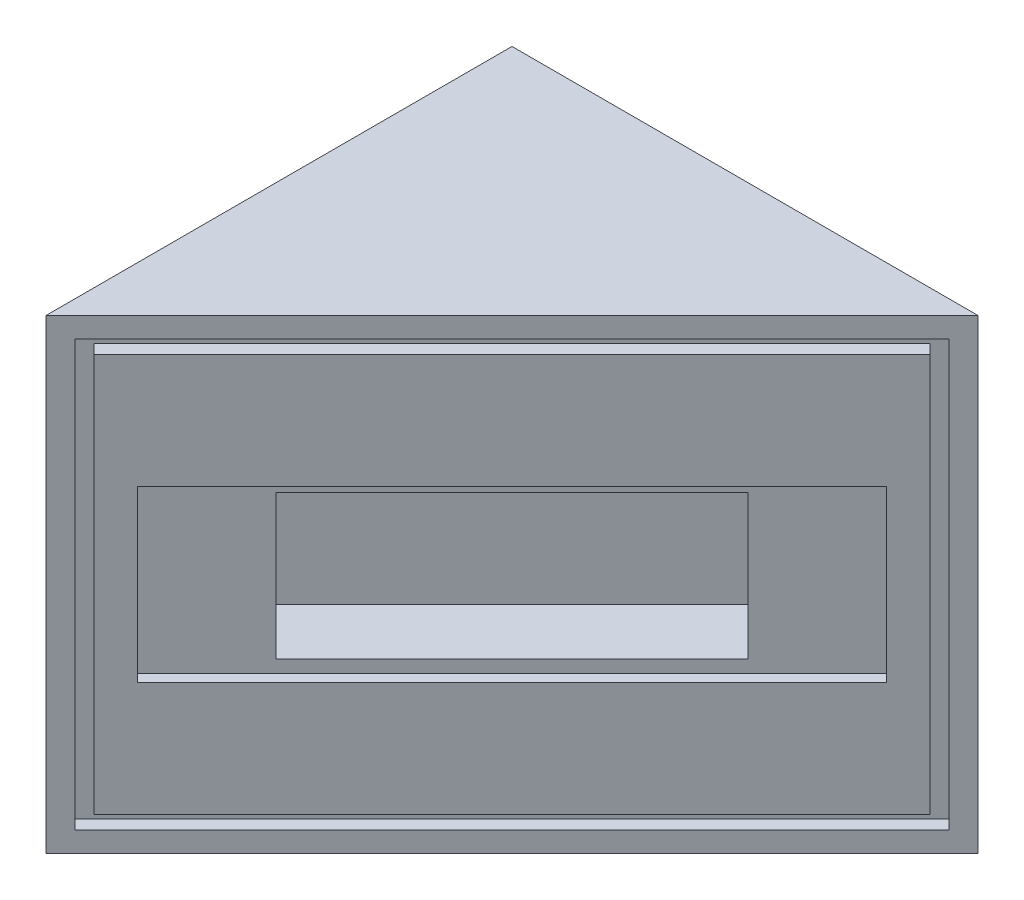
ISO-10303-21;
HEADER;
FILE_DESCRIPTION(('STEP AP214'),'2;1');
FILE_NAME('part.step','',(''),(''),'','','');
FILE_SCHEMA(('AUTOMOTIVE_DESIGN { 1 0 10303 214 1 1 1 1 }'));
ENDSEC;
DATA;
#1=APPLICATION_CONTEXT('core data for automotive mechanical design processes');
#2=APPLICATION_PROTOCOL_DEFINITION('international standard','automotive_design',2000,#1);
#3=PRODUCT_CONTEXT('',#1,'mechanical');
#4=PRODUCT('Part','Part','',(#3));
#5=PRODUCT_RELATED_PRODUCT_CATEGORY('part','',(#4));
#6=PRODUCT_DEFINITION_FORMATION('','',#4);
#7=PRODUCT_DEFINITION_CONTEXT('part definition',#1,'design');
#8=PRODUCT_DEFINITION('design','',#6,#7);
#9=PRODUCT_DEFINITION_SHAPE('','',#8);
#10=(LENGTH_UNIT() NAMED_UNIT(*) SI_UNIT(.MILLI.,.METRE.));
#11=(NAMED_UNIT(*) PLANE_ANGLE_UNIT() SI_UNIT($,.RADIAN.));
#12=(NAMED_UNIT(*) SI_UNIT($,.STERADIAN.) SOLID_ANGLE_UNIT());
#13=UNCERTAINTY_MEASURE_WITH_UNIT(LENGTH_MEASURE(1.E-05),#10,'distance_accuracy_value','');
#14=(GEOMETRIC_REPRESENTATION_CONTEXT(3) GLOBAL_UNCERTAINTY_ASSIGNED_CONTEXT((#13)) GLOBAL_UNIT_ASSIGNED_CONTEXT((#10,
#11,#12)) REPRESENTATION_CONTEXT('',''));
#15=CARTESIAN_POINT('',(0.,0.,0.));
#16=DIRECTION('',(0.,0.,1.));
#17=DIRECTION('',(1.,0.,0.));
#18=AXIS2_PLACEMENT_3D('',#15,#16,#17);
#19=CARTESIAN_POINT('',(0.,69.85,-69.85));
#20=DIRECTION('',(0.,0.,1.));
#21=DIRECTION('',(1.,0.,0.));
#22=AXIS2_PLACEMENT_3D('',#19,#20,#21);
#23=PLANE('',#22);
#24=DIRECTION('',(-1.,0.,0.));
#25=VECTOR('',#24,1.);
#26=CARTESIAN_POINT('',(0.,0.,-69.85));
#27=LINE('',#26,#25);
#28=CARTESIAN_POINT('',(69.85,0.,-69.85));
#29=VERTEX_POINT('',#28);
#30=CARTESIAN_POINT('',(0.,0.,-69.85));
#31=VERTEX_POINT('',#30);
#32=EDGE_CURVE('E67',#29,#31,#27,.T.);
#33=ORIENTED_EDGE('',*,*,#32,.T.);
#34=DIRECTION('',(0.,-1.,0.));
#35=VECTOR('',#34,1.);
#36=CARTESIAN_POINT('',(0.,69.85,-69.85));
#37=LINE('',#36,#35);
#38=CARTESIAN_POINT('',(0.,69.85,-69.85));
#39=VERTEX_POINT('',#38);
#40=EDGE_CURVE('E92',#39,#31,#37,.T.);
#41=ORIENTED_EDGE('',*,*,#40,.F.);
#42=DIRECTION('',(-1.,0.,0.));
#43=VECTOR('',#42,1.);
#44=CARTESIAN_POINT('',(0.,69.85,-69.85));
#45=LINE('',#44,#43);
#46=CARTESIAN_POINT('',(69.85,69.85,-69.85));
#47=VERTEX_POINT('',#46);
#48=EDGE_CURVE('E63',#47,#39,#45,.T.);
#49=ORIENTED_EDGE('',*,*,#48,.F.);
#50=DIRECTION('',(0.,-1.,0.));
#51=VECTOR('',#50,1.);
#52=CARTESIAN_POINT('',(69.8499999999999,69.85,-69.85));
#53=LINE('',#52,#51);
#54=EDGE_CURVE('E12',#47,#29,#53,.T.);
#55=ORIENTED_EDGE('',*,*,#54,.T.);
#56=EDGE_LOOP('',(#33,#41,#49,#55));
#57=FACE_BOUND('',#56,.T.);
#58=ADVANCED_FACE('F57',(#57),#23,.F.);
#59=CARTESIAN_POINT('',(0.,69.85,0.));
#60=DIRECTION('',(1.,0.,0.));
#61=DIRECTION('',(0.,0.,-1.));
#62=AXIS2_PLACEMENT_3D('',#59,#60,#61);
#63=PLANE('',#62);
#64=DIRECTION('',(0.,0.,1.));
#65=VECTOR('',#64,1.);
#66=CARTESIAN_POINT('',(0.,0.,0.));
#67=LINE('',#66,#65);
#68=CARTESIAN_POINT('',(0.,0.,0.));
#69=VERTEX_POINT('',#68);
#70=EDGE_CURVE('E87',#31,#69,#67,.T.);
#71=ORIENTED_EDGE('',*,*,#70,.T.);
#72=DIRECTION('',(0.,-1.,0.));
#73=VECTOR('',#72,1.);
#74=CARTESIAN_POINT('',(0.,69.85,0.));
#75=LINE('',#74,#73);
#76=CARTESIAN_POINT('',(0.,69.85,0.));
#77=VERTEX_POINT('',#76);
#78=EDGE_CURVE('E90',#77,#69,#75,.T.);
#79=ORIENTED_EDGE('',*,*,#78,.F.);
#80=DIRECTION('',(0.,0.,1.));
#81=VECTOR('',#80,1.);
#82=CARTESIAN_POINT('',(0.,69.85,0.));
#83=LINE('',#82,#81);
#84=EDGE_CURVE('E96',#39,#77,#83,.T.);
#85=ORIENTED_EDGE('',*,*,#84,.F.);
#86=ORIENTED_EDGE('',*,*,#40,.T.);
#87=EDGE_LOOP('',(#71,#79,#85,#86));
#88=FACE_BOUND('',#87,.T.);
#89=ADVANCED_FACE('F89',(#88),#63,.F.);
#90=OPEN_SHELL('',(#58,#89));
#91=SHELL_BASED_SURFACE_MODEL('B2',(#90));
#92=CARTESIAN_POINT('',(0.,69.85,0.));
#93=DIRECTION('',(0.,-1.,0.));
#94=DIRECTION('',(0.,0.,-1.));
#95=AXIS2_PLACEMENT_3D('',#92,#93,#94);
#96=PLANE('',#95);
#97=DIRECTION('',(-0.707106781186548,0.,0.707106781186547));
#98=VECTOR('',#97,1.);
#99=CARTESIAN_POINT('',(34.925,69.85,-34.9249999999999));
#100=LINE('',#99,#98);
#101=CARTESIAN_POINT('',(69.85,69.85,-69.85));
#102=VERTEX_POINT('',#101);
#103=CARTESIAN_POINT('',(0.,69.85,0.));
#104=VERTEX_POINT('',#103);
#105=EDGE_CURVE('E440',#102,#104,#100,.T.);
#106=ORIENTED_EDGE('',*,*,#105,.F.);
#107=DIRECTION('',(-1.,0.,0.));
#108=VECTOR('',#107,1.);
#109=CARTESIAN_POINT('',(0.,69.85,-69.85));
#110=LINE('',#109,#108);
#111=CARTESIAN_POINT('',(0.,69.85,-69.85));
#112=VERTEX_POINT('',#111);
#113=EDGE_CURVE('E460',#102,#112,#110,.T.);
#114=ORIENTED_EDGE('',*,*,#113,.T.);
#115=DIRECTION('',(0.,0.,1.));
#116=VECTOR('',#115,1.);
#117=CARTESIAN_POINT('',(0.,69.85,0.));
#118=LINE('',#117,#116);
#119=EDGE_CURVE('E456',#112,#104,#118,.T.);
#120=ORIENTED_EDGE('',*,*,#119,.T.);
#121=EDGE_LOOP('',(#106,#114,#120));
#122=FACE_BOUND('',#121,.T.);
#123=ADVANCED_FACE('F137',(#122),#96,.F.);
#124=CARTESIAN_POINT('',(0.,0.,0.));
#125=DIRECTION('',(0.,-1.,0.));
#126=DIRECTION('',(0.,0.,-1.));
#127=AXIS2_PLACEMENT_3D('',#124,#125,#126);
#128=PLANE('',#127);
#129=DIRECTION('',(-1.,0.,0.));
#130=VECTOR('',#129,1.);
#131=CARTESIAN_POINT('',(0.,0.,-69.85));
#132=LINE('',#131,#130);
#133=CARTESIAN_POINT('',(69.85,0.,-69.85));
#134=VERTEX_POINT('',#133);
#135=CARTESIAN_POINT('',(0.,0.,-69.85));
#136=VERTEX_POINT('',#135);
#137=EDGE_CURVE('E461',#134,#136,#132,.T.);
#138=ORIENTED_EDGE('',*,*,#137,.F.);
#139=DIRECTION('',(0.707106781186547,0.,-0.707106781186547));
#140=VECTOR('',#139,1.);
#141=CARTESIAN_POINT('',(69.85,0.,-69.85));
#142=LINE('',#141,#140);
#143=CARTESIAN_POINT('',(0.,0.,0.));
#144=VERTEX_POINT('',#143);
#145=EDGE_CURVE('E452',#144,#134,#142,.T.);
#146=ORIENTED_EDGE('',*,*,#145,.F.);
#147=DIRECTION('',(0.,0.,1.));
#148=VECTOR('',#147,1.);
#149=CARTESIAN_POINT('',(0.,0.,0.));
#150=LINE('',#149,#148);
#151=EDGE_CURVE('E455',#136,#144,#150,.T.);
#152=ORIENTED_EDGE('',*,*,#151,.F.);
#153=EDGE_LOOP('',(#138,#146,#152));
#154=FACE_BOUND('',#153,.T.);
#155=ADVANCED_FACE('F484',(#154),#128,.T.);
#156=CARTESIAN_POINT('',(0.,69.85,0.));
#157=DIRECTION('',(1.,0.,0.));
#158=DIRECTION('',(0.,0.,-1.));
#159=AXIS2_PLACEMENT_3D('',#156,#157,#158);
#160=PLANE('',#159);
#161=ORIENTED_EDGE('',*,*,#151,.T.);
#162=DIRECTION('',(0.,-1.,0.));
#163=VECTOR('',#162,1.);
#164=CARTESIAN_POINT('',(0.,69.85,0.));
#165=LINE('',#164,#163);
#166=EDGE_CURVE('E55',#104,#144,#165,.T.);
#167=ORIENTED_EDGE('',*,*,#166,.F.);
#168=ORIENTED_EDGE('',*,*,#119,.F.);
#169=DIRECTION('',(0.,-1.,0.));
#170=VECTOR('',#169,1.);
#171=CARTESIAN_POINT('',(0.,69.85,-69.85));
#172=LINE('',#171,#170);
#173=EDGE_CURVE('E464',#112,#136,#172,.T.);
#174=ORIENTED_EDGE('',*,*,#173,.T.);
#175=EDGE_LOOP('',(#161,#167,#168,#174));
#176=FACE_BOUND('',#175,.T.);
#177=ADVANCED_FACE('F139',(#176),#160,.F.);
#178=CARTESIAN_POINT('',(0.,69.85,-69.85));
#179=DIRECTION('',(0.,0.,1.));
#180=DIRECTION('',(1.,0.,0.));
#181=AXIS2_PLACEMENT_3D('',#178,#179,#180);
#182=PLANE('',#181);
#183=ORIENTED_EDGE('',*,*,#137,.T.);
#184=ORIENTED_EDGE('',*,*,#173,.F.);
#185=ORIENTED_EDGE('',*,*,#113,.F.);
#186=DIRECTION('',(0.,-1.,0.));
#187=VECTOR('',#186,1.);
#188=CARTESIAN_POINT('',(69.8499999999999,69.85,-69.85));
#189=LINE('',#188,#187);
#190=EDGE_CURVE('E146',#102,#134,#189,.T.);
#191=ORIENTED_EDGE('',*,*,#190,.T.);
#192=EDGE_LOOP('',(#183,#184,#185,#191));
#193=FACE_BOUND('',#192,.T.);
#194=ADVANCED_FACE('F477',(#193),#182,.F.);
#195=CARTESIAN_POINT('',(0.,0.,0.));
#196=DIRECTION('',(0.707106781186548,0.,0.707106781186548));
#197=DIRECTION('',(0.707106781186548,0.,-0.707106781186548));
#198=AXIS2_PLACEMENT_3D('',#195,#196,#197);
#199=PLANE('',#198);
#200=DIRECTION('',(0.,1.,0.));
#201=VECTOR('',#200,1.);
#202=CARTESIAN_POINT('',(67.6947385309433,3.04800000000001,-67.6947385309433));
#203=LINE('',#202,#201);
#204=CARTESIAN_POINT('',(67.6947385309433,3.04800000000001,-67.6947385309433));
#205=VERTEX_POINT('',#204);
#206=CARTESIAN_POINT('',(67.6947385309433,66.802,-67.6947385309433));
#207=VERTEX_POINT('',#206);
#208=EDGE_CURVE('E396',#205,#207,#203,.T.);
#209=ORIENTED_EDGE('',*,*,#208,.F.);
#210=DIRECTION('',(0.707106781186547,0.,-0.707106781186548));
#211=VECTOR('',#210,1.);
#212=CARTESIAN_POINT('',(2.1552614690566,3.048,-2.1552614690566));
#213=LINE('',#212,#211);
#214=CARTESIAN_POINT('',(2.1552614690566,3.048,-2.1552614690566));
#215=VERTEX_POINT('',#214);
#216=EDGE_CURVE('E411',#215,#205,#213,.T.);
#217=ORIENTED_EDGE('',*,*,#216,.F.);
#218=DIRECTION('',(0.,-1.,0.));
#219=VECTOR('',#218,1.);
#220=CARTESIAN_POINT('',(2.1552614690566,66.802,-2.1552614690566));
#221=LINE('',#220,#219);
#222=CARTESIAN_POINT('',(2.1552614690566,66.802,-2.1552614690566));
#223=VERTEX_POINT('',#222);
#224=EDGE_CURVE('E430',#223,#215,#221,.T.);
#225=ORIENTED_EDGE('',*,*,#224,.F.);
#226=DIRECTION('',(-0.707106781186548,0.,0.707106781186548));
#227=VECTOR('',#226,1.);
#228=CARTESIAN_POINT('',(67.6947385309433,66.802,-67.6947385309433));
#229=LINE('',#228,#227);
#230=EDGE_CURVE('E426',#207,#223,#229,.T.);
#231=ORIENTED_EDGE('',*,*,#230,.F.);
#232=EDGE_LOOP('',(#209,#217,#225,#231));
#233=FACE_BOUND('',#232,.T.);
#234=ORIENTED_EDGE('',*,*,#105,.T.);
#235=ORIENTED_EDGE('',*,*,#166,.T.);
#236=ORIENTED_EDGE('',*,*,#145,.T.);
#237=ORIENTED_EDGE('',*,*,#190,.F.);
#238=EDGE_LOOP('',(#234,#235,#236,#237));
#239=FACE_BOUND('',#238,.T.);
#240=ADVANCED_FACE('F489',(#233,#239),#199,.T.);
#241=CARTESIAN_POINT('',(66.2578975515722,3.04800000000001,-69.1315795103144));
#242=DIRECTION('',(0.707106781186547,0.,-0.707106781186548));
#243=DIRECTION('',(-0.707106781186548,0.,-0.707106781186547));
#244=AXIS2_PLACEMENT_3D('',#241,#242,#243);
#245=PLANE('',#244);
#246=ORIENTED_EDGE('',*,*,#208,.T.);
#247=DIRECTION('',(0.707106781186548,0.,0.707106781186547));
#248=VECTOR('',#247,1.);
#249=CARTESIAN_POINT('',(66.2578975515723,66.802,-69.1315795103144));
#250=LINE('',#249,#248);
#251=CARTESIAN_POINT('',(66.2578975515723,66.802,-69.1315795103144));
#252=VERTEX_POINT('',#251);
#253=EDGE_CURVE('E423',#252,#207,#250,.T.);
#254=ORIENTED_EDGE('',*,*,#253,.F.);
#255=DIRECTION('',(0.,1.,0.));
#256=VECTOR('',#255,1.);
#257=CARTESIAN_POINT('',(66.2578975515722,3.04800000000001,-69.1315795103144));
#258=LINE('',#257,#256);
#259=CARTESIAN_POINT('',(66.2578975515722,3.04800000000001,-69.1315795103144));
#260=VERTEX_POINT('',#259);
#261=EDGE_CURVE('E406',#260,#252,#258,.T.);
#262=ORIENTED_EDGE('',*,*,#261,.F.);
#263=DIRECTION('',(0.707106781186548,0.,0.707106781186547));
#264=VECTOR('',#263,1.);
#265=CARTESIAN_POINT('',(66.2578975515722,3.04800000000001,-69.1315795103144));
#266=LINE('',#265,#264);
#267=EDGE_CURVE('E437',#260,#205,#266,.T.);
#268=ORIENTED_EDGE('',*,*,#267,.T.);
#269=EDGE_LOOP('',(#246,#254,#262,#268));
#270=FACE_BOUND('',#269,.T.);
#271=ADVANCED_FACE('F491',(#270),#245,.F.);
#272=CARTESIAN_POINT('',(0.718420489685539,3.048,-3.59210244842767));
#273=DIRECTION('',(0.,-1.,0.));
#274=DIRECTION('',(0.,0.,-1.));
#275=AXIS2_PLACEMENT_3D('',#272,#273,#274);
#276=PLANE('',#275);
#277=ORIENTED_EDGE('',*,*,#216,.T.);
#278=ORIENTED_EDGE('',*,*,#267,.F.);
#279=DIRECTION('',(0.707106781186547,0.,-0.707106781186548));
#280=VECTOR('',#279,1.);
#281=CARTESIAN_POINT('',(0.718420489685539,3.048,-3.59210244842767));
#282=LINE('',#281,#280);
#283=CARTESIAN_POINT('',(0.718420489685539,3.048,-3.59210244842767));
#284=VERTEX_POINT('',#283);
#285=EDGE_CURVE('E419',#284,#260,#282,.T.);
#286=ORIENTED_EDGE('',*,*,#285,.F.);
#287=DIRECTION('',(0.707106781186548,0.,0.707106781186547));
#288=VECTOR('',#287,1.);
#289=CARTESIAN_POINT('',(0.718420489685539,3.048,-3.59210244842767));
#290=LINE('',#289,#288);
#291=EDGE_CURVE('E441',#284,#215,#290,.T.);
#292=ORIENTED_EDGE('',*,*,#291,.T.);
#293=EDGE_LOOP('',(#277,#278,#286,#292));
#294=FACE_BOUND('',#293,.T.);
#295=ADVANCED_FACE('F499',(#294),#276,.F.);
#296=CARTESIAN_POINT('',(0.718420489685538,66.802,-3.59210244842767));
#297=DIRECTION('',(-0.707106781186547,0.,0.707106781186548));
#298=DIRECTION('',(0.707106781186548,0.,0.707106781186547));
#299=AXIS2_PLACEMENT_3D('',#296,#297,#298);
#300=PLANE('',#299);
#301=ORIENTED_EDGE('',*,*,#224,.T.);
#302=ORIENTED_EDGE('',*,*,#291,.F.);
#303=DIRECTION('',(0.,-1.,0.));
#304=VECTOR('',#303,1.);
#305=CARTESIAN_POINT('',(0.718420489685538,66.802,-3.59210244842767));
#306=LINE('',#305,#304);
#307=CARTESIAN_POINT('',(0.718420489685538,66.802,-3.59210244842767));
#308=VERTEX_POINT('',#307);
#309=EDGE_CURVE('E415',#308,#284,#306,.T.);
#310=ORIENTED_EDGE('',*,*,#309,.F.);
#311=DIRECTION('',(0.707106781186548,0.,0.707106781186547));
#312=VECTOR('',#311,1.);
#313=CARTESIAN_POINT('',(0.718420489685538,66.802,-3.59210244842767));
#314=LINE('',#313,#312);
#315=EDGE_CURVE('E444',#308,#223,#314,.T.);
#316=ORIENTED_EDGE('',*,*,#315,.T.);
#317=EDGE_LOOP('',(#301,#302,#310,#316));
#318=FACE_BOUND('',#317,.T.);
#319=ADVANCED_FACE('F547',(#318),#300,.F.);
#320=CARTESIAN_POINT('',(66.2578975515723,66.802,-69.1315795103144));
#321=DIRECTION('',(0.,1.,0.));
#322=DIRECTION('',(0.,0.,1.));
#323=AXIS2_PLACEMENT_3D('',#320,#321,#322);
#324=PLANE('',#323);
#325=ORIENTED_EDGE('',*,*,#230,.T.);
#326=ORIENTED_EDGE('',*,*,#315,.F.);
#327=DIRECTION('',(-0.707106781186548,0.,0.707106781186548));
#328=VECTOR('',#327,1.);
#329=CARTESIAN_POINT('',(66.2578975515723,66.802,-69.1315795103144));
#330=LINE('',#329,#328);
#331=EDGE_CURVE('E410',#252,#308,#330,.T.);
#332=ORIENTED_EDGE('',*,*,#331,.F.);
#333=ORIENTED_EDGE('',*,*,#253,.T.);
#334=EDGE_LOOP('',(#325,#326,#332,#333));
#335=FACE_BOUND('',#334,.T.);
#336=ADVANCED_FACE('F558',(#335),#324,.F.);
#337=CARTESIAN_POINT('',(-1.43684097937107,0.,-1.43684097937107));
#338=DIRECTION('',(0.707106781186548,0.,0.707106781186547));
#339=DIRECTION('',(0.707106781186547,0.,-0.707106781186548));
#340=AXIS2_PLACEMENT_3D('',#337,#338,#339);
#341=PLANE('',#340);
#342=DIRECTION('',(0.707106781186547,0.,-0.707106781186548));
#343=VECTOR('',#342,1.);
#344=CARTESIAN_POINT('',(2.1552614690566,5.08,-5.02894342779873));
#345=LINE('',#344,#343);
#346=CARTESIAN_POINT('',(2.1552614690566,5.08,-5.02894342779873));
#347=VERTEX_POINT('',#346);
#348=CARTESIAN_POINT('',(64.8210565722012,5.08,-67.6947385309434));
#349=VERTEX_POINT('',#348);
#350=EDGE_CURVE('E374',#347,#349,#345,.T.);
#351=ORIENTED_EDGE('',*,*,#350,.F.);
#352=DIRECTION('',(0.,-1.,0.));
#353=VECTOR('',#352,1.);
#354=CARTESIAN_POINT('',(2.1552614690566,64.77,-5.02894342779873));
#355=LINE('',#354,#353);
#356=CARTESIAN_POINT('',(2.1552614690566,64.77,-5.02894342779873));
#357=VERTEX_POINT('',#356);
#358=EDGE_CURVE('E370',#357,#347,#355,.T.);
#359=ORIENTED_EDGE('',*,*,#358,.F.);
#360=DIRECTION('',(-0.707106781186547,0.,0.707106781186548));
#361=VECTOR('',#360,1.);
#362=CARTESIAN_POINT('',(64.8210565722012,64.77,-67.6947385309434));
#363=LINE('',#362,#361);
#364=CARTESIAN_POINT('',(64.8210565722012,64.77,-67.6947385309434));
#365=VERTEX_POINT('',#364);
#366=EDGE_CURVE('E365',#365,#357,#363,.T.);
#367=ORIENTED_EDGE('',*,*,#366,.F.);
#368=DIRECTION('',(0.,1.,0.));
#369=VECTOR('',#368,1.);
#370=CARTESIAN_POINT('',(64.8210565722012,5.08,-67.6947385309434));
#371=LINE('',#370,#369);
#372=EDGE_CURVE('E361',#349,#365,#371,.T.);
#373=ORIENTED_EDGE('',*,*,#372,.F.);
#374=EDGE_LOOP('',(#351,#359,#367,#373));
#375=FACE_BOUND('',#374,.T.);
#376=ORIENTED_EDGE('',*,*,#261,.T.);
#377=ORIENTED_EDGE('',*,*,#331,.T.);
#378=ORIENTED_EDGE('',*,*,#309,.T.);
#379=ORIENTED_EDGE('',*,*,#285,.T.);
#380=EDGE_LOOP('',(#376,#377,#378,#379));
#381=FACE_BOUND('',#380,.T.);
#382=ADVANCED_FACE('F569',(#375,#381),#341,.T.);
#383=CARTESIAN_POINT('',(64.8210565722012,5.08,-67.6947385309434));
#384=DIRECTION('',(0.707106781186547,0.,-0.707106781186548));
#385=DIRECTION('',(-0.707106781186548,0.,-0.707106781186547));
#386=AXIS2_PLACEMENT_3D('',#383,#384,#385);
#387=PLANE('',#386);
#388=DIRECTION('',(0.,1.,0.));
#389=VECTOR('',#388,1.);
#390=CARTESIAN_POINT('',(66.2578975515723,5.08,-66.2578975515723));
#391=LINE('',#390,#389);
#392=CARTESIAN_POINT('',(66.2578975515723,5.08,-66.2578975515723));
#393=VERTEX_POINT('',#392);
#394=CARTESIAN_POINT('',(66.2578975515723,64.77,-66.2578975515723));
#395=VERTEX_POINT('',#394);
#396=EDGE_CURVE('E352',#393,#395,#391,.T.);
#397=ORIENTED_EDGE('',*,*,#396,.F.);
#398=DIRECTION('',(0.707106781186548,0.,0.707106781186547));
#399=VECTOR('',#398,1.);
#400=CARTESIAN_POINT('',(64.8210565722012,5.08,-67.6947385309434));
#401=LINE('',#400,#399);
#402=EDGE_CURVE('E393',#349,#393,#401,.T.);
#403=ORIENTED_EDGE('',*,*,#402,.F.);
#404=ORIENTED_EDGE('',*,*,#372,.T.);
#405=DIRECTION('',(0.707106781186548,0.,0.707106781186547));
#406=VECTOR('',#405,1.);
#407=CARTESIAN_POINT('',(64.8210565722012,64.77,-67.6947385309434));
#408=LINE('',#407,#406);
#409=EDGE_CURVE('E378',#365,#395,#408,.T.);
#410=ORIENTED_EDGE('',*,*,#409,.T.);
#411=EDGE_LOOP('',(#397,#403,#404,#410));
#412=FACE_BOUND('',#411,.T.);
#413=ADVANCED_FACE('F580',(#412),#387,.T.);
#414=CARTESIAN_POINT('',(2.1552614690566,5.08,-5.02894342779873));
#415=DIRECTION('',(0.,-1.,0.));
#416=DIRECTION('',(0.,0.,-1.));
#417=AXIS2_PLACEMENT_3D('',#414,#415,#416);
#418=PLANE('',#417);
#419=DIRECTION('',(0.707106781186547,0.,-0.707106781186548));
#420=VECTOR('',#419,1.);
#421=CARTESIAN_POINT('',(3.59210244842766,5.08,-3.59210244842767));
#422=LINE('',#421,#420);
#423=CARTESIAN_POINT('',(3.59210244842766,5.08,-3.59210244842767));
#424=VERTEX_POINT('',#423);
#425=EDGE_CURVE('E366',#424,#393,#422,.T.);
#426=ORIENTED_EDGE('',*,*,#425,.F.);
#427=DIRECTION('',(0.707106781186548,0.,0.707106781186547));
#428=VECTOR('',#427,1.);
#429=CARTESIAN_POINT('',(2.1552614690566,5.08,-5.02894342779873));
#430=LINE('',#429,#428);
#431=EDGE_CURVE('E397',#347,#424,#430,.T.);
#432=ORIENTED_EDGE('',*,*,#431,.F.);
#433=ORIENTED_EDGE('',*,*,#350,.T.);
#434=ORIENTED_EDGE('',*,*,#402,.T.);
#435=EDGE_LOOP('',(#426,#432,#433,#434));
#436=FACE_BOUND('',#435,.T.);
#437=ADVANCED_FACE('F591',(#436),#418,.T.);
#438=CARTESIAN_POINT('',(2.1552614690566,64.77,-5.02894342779873));
#439=DIRECTION('',(-0.707106781186547,0.,0.707106781186548));
#440=DIRECTION('',(0.707106781186548,0.,0.707106781186547));
#441=AXIS2_PLACEMENT_3D('',#438,#439,#440);
#442=PLANE('',#441);
#443=DIRECTION('',(0.,-1.,0.));
#444=VECTOR('',#443,1.);
#445=CARTESIAN_POINT('',(3.59210244842766,64.77,-3.59210244842766));
#446=LINE('',#445,#444);
#447=CARTESIAN_POINT('',(3.59210244842766,64.77,-3.59210244842766));
#448=VERTEX_POINT('',#447);
#449=EDGE_CURVE('E386',#448,#424,#446,.T.);
#450=ORIENTED_EDGE('',*,*,#449,.F.);
#451=DIRECTION('',(0.707106781186548,0.,0.707106781186547));
#452=VECTOR('',#451,1.);
#453=CARTESIAN_POINT('',(2.1552614690566,64.77,-5.02894342779873));
#454=LINE('',#453,#452);
#455=EDGE_CURVE('E400',#357,#448,#454,.T.);
#456=ORIENTED_EDGE('',*,*,#455,.F.);
#457=ORIENTED_EDGE('',*,*,#358,.T.);
#458=ORIENTED_EDGE('',*,*,#431,.T.);
#459=EDGE_LOOP('',(#450,#456,#457,#458));
#460=FACE_BOUND('',#459,.T.);
#461=ADVANCED_FACE('F602',(#460),#442,.T.);
#462=CARTESIAN_POINT('',(64.8210565722012,64.77,-67.6947385309434));
#463=DIRECTION('',(0.,1.,0.));
#464=DIRECTION('',(0.,0.,1.));
#465=AXIS2_PLACEMENT_3D('',#462,#463,#464);
#466=PLANE('',#465);
#467=DIRECTION('',(-0.707106781186547,0.,0.707106781186548));
#468=VECTOR('',#467,1.);
#469=CARTESIAN_POINT('',(66.2578975515723,64.77,-66.2578975515723));
#470=LINE('',#469,#468);
#471=EDGE_CURVE('E382',#395,#448,#470,.T.);
#472=ORIENTED_EDGE('',*,*,#471,.F.);
#473=ORIENTED_EDGE('',*,*,#409,.F.);
#474=ORIENTED_EDGE('',*,*,#366,.T.);
#475=ORIENTED_EDGE('',*,*,#455,.T.);
#476=EDGE_LOOP('',(#472,#473,#474,#475));
#477=FACE_BOUND('',#476,.T.);
#478=ADVANCED_FACE('F506',(#477),#466,.T.);
#479=DIRECTION('',(0.,-1.,0.));
#480=VECTOR('',#479,1.);
#481=CARTESIAN_POINT('',(6.86169962165886,47.625,-6.86169962165886));
#482=LINE('',#481,#480);
#483=CARTESIAN_POINT('',(6.86169962165886,47.625,-6.86169962165886));
#484=VERTEX_POINT('',#483);
#485=CARTESIAN_POINT('',(6.86169962165886,22.225,-6.86169962165886));
#486=VERTEX_POINT('',#485);
#487=EDGE_CURVE('E161',#484,#486,#482,.T.);
#488=ORIENTED_EDGE('',*,*,#487,.F.);
#489=DIRECTION('',(-0.707106781186547,0.,0.707106781186548));
#490=VECTOR('',#489,1.);
#491=CARTESIAN_POINT('',(62.9883003783411,47.625,-62.9883003783411));
#492=LINE('',#491,#490);
#493=CARTESIAN_POINT('',(62.9883003783411,47.625,-62.9883003783411));
#494=VERTEX_POINT('',#493);
#495=EDGE_CURVE('E323',#494,#484,#492,.T.);
#496=ORIENTED_EDGE('',*,*,#495,.F.);
#497=DIRECTION('',(0.,1.,0.));
#498=VECTOR('',#497,1.);
#499=CARTESIAN_POINT('',(62.9883003783411,22.225,-62.9883003783411));
#500=LINE('',#499,#498);
#501=CARTESIAN_POINT('',(62.9883003783411,22.225,-62.9883003783411));
#502=VERTEX_POINT('',#501);
#503=EDGE_CURVE('E342',#502,#494,#500,.T.);
#504=ORIENTED_EDGE('',*,*,#503,.F.);
#505=DIRECTION('',(0.707106781186547,0.,-0.707106781186548));
#506=VECTOR('',#505,1.);
#507=CARTESIAN_POINT('',(6.86169962165886,22.225,-6.86169962165886));
#508=LINE('',#507,#506);
#509=EDGE_CURVE('E338',#486,#502,#508,.T.);
#510=ORIENTED_EDGE('',*,*,#509,.F.);
#511=EDGE_LOOP('',(#488,#496,#504,#510));
#512=FACE_BOUND('',#511,.T.);
#513=ORIENTED_EDGE('',*,*,#425,.T.);
#514=ORIENTED_EDGE('',*,*,#396,.T.);
#515=ORIENTED_EDGE('',*,*,#471,.T.);
#516=ORIENTED_EDGE('',*,*,#449,.T.);
#517=EDGE_LOOP('',(#513,#514,#515,#516));
#518=FACE_BOUND('',#517,.T.);
#519=ADVANCED_FACE('F494',(#512,#518),#199,.T.);
#520=CARTESIAN_POINT('',(5.73032877176038,47.625,-7.99307047155733));
#521=DIRECTION('',(-0.707106781186548,0.,0.707106781186548));
#522=DIRECTION('',(0.707106781186548,0.,0.707106781186547));
#523=AXIS2_PLACEMENT_3D('',#520,#521,#522);
#524=PLANE('',#523);
#525=ORIENTED_EDGE('',*,*,#487,.T.);
#526=DIRECTION('',(0.707106781186548,0.,0.707106781186548));
#527=VECTOR('',#526,1.);
#528=CARTESIAN_POINT('',(5.73032877176038,22.225,-7.99307047155734));
#529=LINE('',#528,#527);
#530=CARTESIAN_POINT('',(5.73032877176038,22.225,-7.99307047155734));
#531=VERTEX_POINT('',#530);
#532=EDGE_CURVE('E335',#531,#486,#529,.T.);
#533=ORIENTED_EDGE('',*,*,#532,.F.);
#534=DIRECTION('',(0.,-1.,0.));
#535=VECTOR('',#534,1.);
#536=CARTESIAN_POINT('',(5.73032877176038,47.625,-7.99307047155733));
#537=LINE('',#536,#535);
#538=CARTESIAN_POINT('',(5.73032877176038,47.625,-7.99307047155733));
#539=VERTEX_POINT('',#538);
#540=EDGE_CURVE('E318',#539,#531,#537,.T.);
#541=ORIENTED_EDGE('',*,*,#540,.F.);
#542=DIRECTION('',(0.707106781186548,0.,0.707106781186548));
#543=VECTOR('',#542,1.);
#544=CARTESIAN_POINT('',(5.73032877176038,47.625,-7.99307047155733));
#545=LINE('',#544,#543);
#546=EDGE_CURVE('E349',#539,#484,#545,.T.);
#547=ORIENTED_EDGE('',*,*,#546,.T.);
#548=EDGE_LOOP('',(#525,#533,#541,#547));
#549=FACE_BOUND('',#548,.T.);
#550=ADVANCED_FACE('F505',(#549),#524,.F.);
#551=CARTESIAN_POINT('',(61.8569295284426,47.625,-64.1196712282396));
#552=DIRECTION('',(0.,1.,0.));
#553=DIRECTION('',(0.,0.,1.));
#554=AXIS2_PLACEMENT_3D('',#551,#552,#553);
#555=PLANE('',#554);
#556=ORIENTED_EDGE('',*,*,#495,.T.);
#557=ORIENTED_EDGE('',*,*,#546,.F.);
#558=DIRECTION('',(-0.707106781186547,0.,0.707106781186548));
#559=VECTOR('',#558,1.);
#560=CARTESIAN_POINT('',(61.8569295284426,47.625,-64.1196712282396));
#561=LINE('',#560,#559);
#562=CARTESIAN_POINT('',(61.8569295284426,47.625,-64.1196712282396));
#563=VERTEX_POINT('',#562);
#564=EDGE_CURVE('E331',#563,#539,#561,.T.);
#565=ORIENTED_EDGE('',*,*,#564,.F.);
#566=DIRECTION('',(0.707106781186548,0.,0.707106781186548));
#567=VECTOR('',#566,1.);
#568=CARTESIAN_POINT('',(61.8569295284426,47.625,-64.1196712282396));
#569=LINE('',#568,#567);
#570=EDGE_CURVE('E353',#563,#494,#569,.T.);
#571=ORIENTED_EDGE('',*,*,#570,.T.);
#572=EDGE_LOOP('',(#556,#557,#565,#571));
#573=FACE_BOUND('',#572,.T.);
#574=ADVANCED_FACE('F638',(#573),#555,.F.);
#575=CARTESIAN_POINT('',(61.8569295284426,22.225,-64.1196712282396));
#576=DIRECTION('',(0.707106781186547,0.,-0.707106781186548));
#577=DIRECTION('',(-0.707106781186548,0.,-0.707106781186547));
#578=AXIS2_PLACEMENT_3D('',#575,#576,#577);
#579=PLANE('',#578);
#580=ORIENTED_EDGE('',*,*,#503,.T.);
#581=ORIENTED_EDGE('',*,*,#570,.F.);
#582=DIRECTION('',(0.,1.,0.));
#583=VECTOR('',#582,1.);
#584=CARTESIAN_POINT('',(61.8569295284426,22.225,-64.1196712282396));
#585=LINE('',#584,#583);
#586=CARTESIAN_POINT('',(61.8569295284426,22.225,-64.1196712282396));
#587=VERTEX_POINT('',#586);
#588=EDGE_CURVE('E327',#587,#563,#585,.T.);
#589=ORIENTED_EDGE('',*,*,#588,.F.);
#590=DIRECTION('',(0.707106781186548,0.,0.707106781186548));
#591=VECTOR('',#590,1.);
#592=CARTESIAN_POINT('',(61.8569295284426,22.225,-64.1196712282396));
#593=LINE('',#592,#591);
#594=EDGE_CURVE('E356',#587,#502,#593,.T.);
#595=ORIENTED_EDGE('',*,*,#594,.T.);
#596=EDGE_LOOP('',(#580,#581,#589,#595));
#597=FACE_BOUND('',#596,.T.);
#598=ADVANCED_FACE('F648',(#597),#579,.F.);
#599=CARTESIAN_POINT('',(5.73032877176038,22.225,-7.99307047155734));
#600=DIRECTION('',(0.,-1.,0.));
#601=DIRECTION('',(0.,0.,-1.));
#602=AXIS2_PLACEMENT_3D('',#599,#600,#601);
#603=PLANE('',#602);
#604=ORIENTED_EDGE('',*,*,#509,.T.);
#605=ORIENTED_EDGE('',*,*,#594,.F.);
#606=DIRECTION('',(0.707106781186547,0.,-0.707106781186548));
#607=VECTOR('',#606,1.);
#608=CARTESIAN_POINT('',(5.73032877176038,22.225,-7.99307047155734));
#609=LINE('',#608,#607);
#610=EDGE_CURVE('E322',#531,#587,#609,.T.);
#611=ORIENTED_EDGE('',*,*,#610,.F.);
#612=ORIENTED_EDGE('',*,*,#532,.T.);
#613=EDGE_LOOP('',(#604,#605,#611,#612));
#614=FACE_BOUND('',#613,.T.);
#615=ADVANCED_FACE('F659',(#614),#603,.F.);
#616=CARTESIAN_POINT('',(-1.13137084989848,0.,-1.13137084989848));
#617=DIRECTION('',(0.707106781186548,0.,0.707106781186547));
#618=DIRECTION('',(0.707106781186547,0.,-0.707106781186548));
#619=AXIS2_PLACEMENT_3D('',#616,#617,#618);
#620=PLANE('',#619);
#621=DIRECTION('',(0.,1.,0.));
#622=VECTOR('',#621,1.);
#623=CARTESIAN_POINT('',(51.4712986797652,45.72,-53.7340403795621));
#624=LINE('',#623,#622);
#625=CARTESIAN_POINT('',(51.4712986797652,24.13,-53.7340403795621));
#626=VERTEX_POINT('',#625);
#627=CARTESIAN_POINT('',(51.4712986797652,45.72,-53.7340403795622));
#628=VERTEX_POINT('',#627);
#629=EDGE_CURVE('E153',#626,#628,#624,.T.);
#630=ORIENTED_EDGE('',*,*,#629,.F.);
#631=DIRECTION('',(0.707106781186547,0.,-0.707106781186547));
#632=VECTOR('',#631,1.);
#633=CARTESIAN_POINT('',(16.1159596204378,24.13,-18.3787013202348));
#634=LINE('',#633,#632);
#635=CARTESIAN_POINT('',(16.1159596204378,24.13,-18.3787013202348));
#636=VERTEX_POINT('',#635);
#637=EDGE_CURVE('E291',#636,#626,#634,.T.);
#638=ORIENTED_EDGE('',*,*,#637,.F.);
#639=DIRECTION('',(0.,-1.,0.));
#640=VECTOR('',#639,1.);
#641=CARTESIAN_POINT('',(16.1159596204378,45.72,-18.3787013202347));
#642=LINE('',#641,#640);
#643=CARTESIAN_POINT('',(16.1159596204378,45.72,-18.3787013202347));
#644=VERTEX_POINT('',#643);
#645=EDGE_CURVE('E295',#644,#636,#642,.T.);
#646=ORIENTED_EDGE('',*,*,#645,.F.);
#647=DIRECTION('',(-0.707106781186547,0.,0.707106781186547));
#648=VECTOR('',#647,1.);
#649=CARTESIAN_POINT('',(16.1159596204378,45.72,-18.3787013202347));
#650=LINE('',#649,#648);
#651=EDGE_CURVE('E304',#628,#644,#650,.T.);
#652=ORIENTED_EDGE('',*,*,#651,.F.);
#653=EDGE_LOOP('',(#630,#638,#646,#652));
#654=FACE_BOUND('',#653,.T.);
#655=ORIENTED_EDGE('',*,*,#540,.T.);
#656=ORIENTED_EDGE('',*,*,#610,.T.);
#657=ORIENTED_EDGE('',*,*,#588,.T.);
#658=ORIENTED_EDGE('',*,*,#564,.T.);
#659=EDGE_LOOP('',(#655,#656,#657,#658));
#660=FACE_BOUND('',#659,.T.);
#661=ADVANCED_FACE('F670',(#654,#660),#620,.T.);
#662=CARTESIAN_POINT('',(44.4002308678997,45.72,-60.8051081914276));
#663=DIRECTION('',(0.707106781186548,0.,-0.707106781186548));
#664=DIRECTION('',(-0.707106781186548,0.,-0.707106781186548));
#665=AXIS2_PLACEMENT_3D('',#662,#663,#664);
#666=PLANE('',#665);
#667=ORIENTED_EDGE('',*,*,#629,.T.);
#668=DIRECTION('',(0.707106781186548,0.,0.707106781186548));
#669=VECTOR('',#668,1.);
#670=CARTESIAN_POINT('',(44.4002308678997,45.72,-60.8051081914276));
#671=LINE('',#670,#669);
#672=CARTESIAN_POINT('',(44.4002308678997,45.72,-60.8051081914276));
#673=VERTEX_POINT('',#672);
#674=EDGE_CURVE('E266',#673,#628,#671,.T.);
#675=ORIENTED_EDGE('',*,*,#674,.F.);
#676=DIRECTION('',(0.,1.,0.));
#677=VECTOR('',#676,1.);
#678=CARTESIAN_POINT('',(44.4002308678997,45.72,-60.8051081914276));
#679=LINE('',#678,#677);
#680=CARTESIAN_POINT('',(44.4002308678997,24.13,-60.8051081914276));
#681=VERTEX_POINT('',#680);
#682=EDGE_CURVE('E270',#681,#673,#679,.T.);
#683=ORIENTED_EDGE('',*,*,#682,.F.);
#684=DIRECTION('',(0.707106781186548,0.,0.707106781186548));
#685=VECTOR('',#684,1.);
#686=CARTESIAN_POINT('',(44.4002308678997,24.13,-60.8051081914276));
#687=LINE('',#686,#685);
#688=EDGE_CURVE('E310',#681,#626,#687,.T.);
#689=ORIENTED_EDGE('',*,*,#688,.T.);
#690=EDGE_LOOP('',(#667,#675,#683,#689));
#691=FACE_BOUND('',#690,.T.);
#692=ADVANCED_FACE('F268',(#691),#666,.F.);
#693=CARTESIAN_POINT('',(9.04489180857232,24.13,-25.4497691321002));
#694=DIRECTION('',(0.,-1.,0.));
#695=DIRECTION('',(0.,0.,-1.));
#696=AXIS2_PLACEMENT_3D('',#693,#694,#695);
#697=PLANE('',#696);
#698=ORIENTED_EDGE('',*,*,#637,.T.);
#699=ORIENTED_EDGE('',*,*,#688,.F.);
#700=DIRECTION('',(0.707106781186547,0.,-0.707106781186547));
#701=VECTOR('',#700,1.);
#702=CARTESIAN_POINT('',(9.04489180857232,24.13,-25.4497691321002));
#703=LINE('',#702,#701);
#704=CARTESIAN_POINT('',(9.04489180857232,24.13,-25.4497691321002));
#705=VERTEX_POINT('',#704);
#706=EDGE_CURVE('E277',#705,#681,#703,.T.);
#707=ORIENTED_EDGE('',*,*,#706,.F.);
#708=DIRECTION('',(0.707106781186548,0.,0.707106781186548));
#709=VECTOR('',#708,1.);
#710=CARTESIAN_POINT('',(9.04489180857232,24.13,-25.4497691321002));
#711=LINE('',#710,#709);
#712=EDGE_CURVE('E313',#705,#636,#711,.T.);
#713=ORIENTED_EDGE('',*,*,#712,.T.);
#714=EDGE_LOOP('',(#698,#699,#707,#713));
#715=FACE_BOUND('',#714,.T.);
#716=ADVANCED_FACE('F691',(#715),#697,.F.);
#717=CARTESIAN_POINT('',(9.04489180857231,45.72,-25.4497691321002));
#718=DIRECTION('',(-0.707106781186548,0.,0.707106781186548));
#719=DIRECTION('',(0.707106781186548,0.,0.707106781186548));
#720=AXIS2_PLACEMENT_3D('',#717,#718,#719);
#721=PLANE('',#720);
#722=ORIENTED_EDGE('',*,*,#645,.T.);
#723=ORIENTED_EDGE('',*,*,#712,.F.);
#724=DIRECTION('',(0.,-1.,0.));
#725=VECTOR('',#724,1.);
#726=CARTESIAN_POINT('',(9.04489180857231,45.72,-25.4497691321002));
#727=LINE('',#726,#725);
#728=CARTESIAN_POINT('',(9.04489180857231,45.72,-25.4497691321002));
#729=VERTEX_POINT('',#728);
#730=EDGE_CURVE('E286',#729,#705,#727,.T.);
#731=ORIENTED_EDGE('',*,*,#730,.F.);
#732=DIRECTION('',(0.707106781186548,0.,0.707106781186548));
#733=VECTOR('',#732,1.);
#734=CARTESIAN_POINT('',(9.04489180857231,45.72,-25.4497691321002));
#735=LINE('',#734,#733);
#736=EDGE_CURVE('E276',#729,#644,#735,.T.);
#737=ORIENTED_EDGE('',*,*,#736,.T.);
#738=EDGE_LOOP('',(#722,#723,#731,#737));
#739=FACE_BOUND('',#738,.T.);
#740=ADVANCED_FACE('F701',(#739),#721,.F.);
#741=CARTESIAN_POINT('',(9.04489180857231,45.72,-25.4497691321002));
#742=DIRECTION('',(0.,1.,0.));
#743=DIRECTION('',(0.,0.,1.));
#744=AXIS2_PLACEMENT_3D('',#741,#742,#743);
#745=PLANE('',#744);
#746=ORIENTED_EDGE('',*,*,#651,.T.);
#747=ORIENTED_EDGE('',*,*,#736,.F.);
#748=DIRECTION('',(-0.707106781186547,0.,0.707106781186547));
#749=VECTOR('',#748,1.);
#750=CARTESIAN_POINT('',(9.04489180857231,45.72,-25.4497691321002));
#751=LINE('',#750,#749);
#752=EDGE_CURVE('E280',#673,#729,#751,.T.);
#753=ORIENTED_EDGE('',*,*,#752,.F.);
#754=ORIENTED_EDGE('',*,*,#674,.T.);
#755=EDGE_LOOP('',(#746,#747,#753,#754));
#756=FACE_BOUND('',#755,.T.);
#757=ADVANCED_FACE('F281',(#756),#745,.F.);
#758=CARTESIAN_POINT('',(-8.20243866176396,0.,-8.20243866176396));
#759=DIRECTION('',(0.707106781186548,0.,0.707106781186548));
#760=DIRECTION('',(0.707106781186548,0.,-0.707106781186548));
#761=AXIS2_PLACEMENT_3D('',#758,#759,#760);
#762=PLANE('',#761);
#763=ORIENTED_EDGE('',*,*,#682,.T.);
#764=ORIENTED_EDGE('',*,*,#752,.T.);
#765=ORIENTED_EDGE('',*,*,#730,.T.);
#766=ORIENTED_EDGE('',*,*,#706,.T.);
#767=EDGE_LOOP('',(#763,#764,#765,#766));
#768=FACE_BOUND('',#767,.T.);
#769=ADVANCED_FACE('F288',(#768),#762,.T.);
#770=CLOSED_SHELL('',(#123,#155,#177,#194,#240,#271,#295,#319,#336,#382,#413,#437,#461,#478,
#519,#550,#574,#598,#615,#661,#692,#716,#740,#757,#769));
#771=MANIFOLD_SOLID_BREP('B6',#770);
#772=ADVANCED_BREP_SHAPE_REPRESENTATION('',(#18,#771),#14);
#773=MANIFOLD_SURFACE_SHAPE_REPRESENTATION('',(#18,#91),#14);
#774=SHAPE_REPRESENTATION('',(#18),#14);
#775=SHAPE_DEFINITION_REPRESENTATION(#9,#774);
#776=SHAPE_REPRESENTATION_RELATIONSHIP('','',#774,#772);
#777=SHAPE_REPRESENTATION_RELATIONSHIP('','',#774,#773);
ENDSEC;
END-ISO-10303-21;
